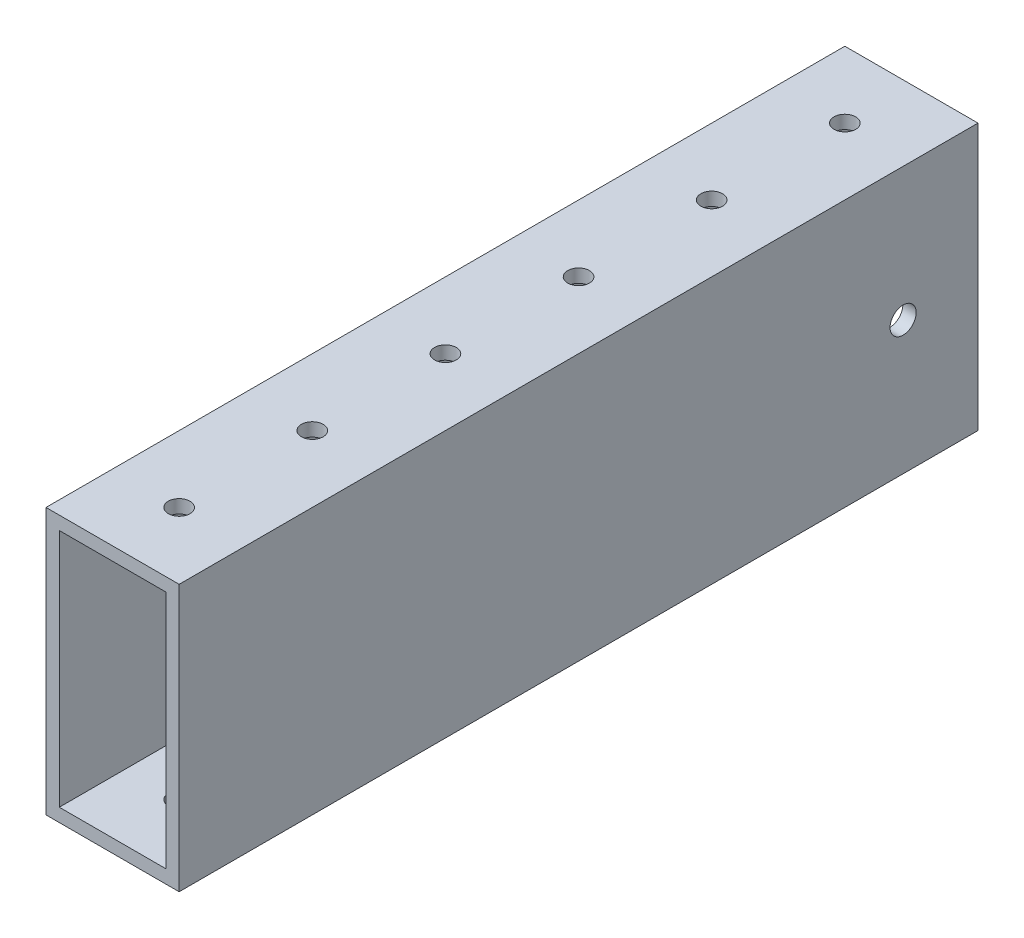
ISO-10303-21;
HEADER;
FILE_DESCRIPTION(('STEP AP214'),'2;1');
FILE_NAME('part.step','',(''),(''),'','','');
FILE_SCHEMA(('AUTOMOTIVE_DESIGN { 1 0 10303 214 1 1 1 1 }'));
ENDSEC;
DATA;
#1=APPLICATION_CONTEXT('core data for automotive mechanical design processes');
#2=APPLICATION_PROTOCOL_DEFINITION('international standard','automotive_design',2000,#1);
#3=PRODUCT_CONTEXT('',#1,'mechanical');
#4=PRODUCT('Part','Part','',(#3));
#5=PRODUCT_RELATED_PRODUCT_CATEGORY('part','',(#4));
#6=PRODUCT_DEFINITION_FORMATION('','',#4);
#7=PRODUCT_DEFINITION_CONTEXT('part definition',#1,'design');
#8=PRODUCT_DEFINITION('design','',#6,#7);
#9=PRODUCT_DEFINITION_SHAPE('','',#8);
#10=(LENGTH_UNIT() NAMED_UNIT(*) SI_UNIT(.MILLI.,.METRE.));
#11=(NAMED_UNIT(*) PLANE_ANGLE_UNIT() SI_UNIT($,.RADIAN.));
#12=(NAMED_UNIT(*) SI_UNIT($,.STERADIAN.) SOLID_ANGLE_UNIT());
#13=UNCERTAINTY_MEASURE_WITH_UNIT(LENGTH_MEASURE(1.E-05),#10,'distance_accuracy_value','');
#14=(GEOMETRIC_REPRESENTATION_CONTEXT(3) GLOBAL_UNCERTAINTY_ASSIGNED_CONTEXT((#13)) GLOBAL_UNIT_ASSIGNED_CONTEXT((#10,
#11,#12)) REPRESENTATION_CONTEXT('',''));
#15=CARTESIAN_POINT('',(0.,0.,0.));
#16=DIRECTION('',(0.,0.,1.));
#17=DIRECTION('',(1.,0.,0.));
#18=AXIS2_PLACEMENT_3D('',#15,#16,#17);
#19=CARTESIAN_POINT('',(0.,0.,76.2));
#20=DIRECTION('',(0.,0.,1.));
#21=DIRECTION('',(1.,0.,0.));
#22=AXIS2_PLACEMENT_3D('',#19,#20,#21);
#23=PLANE('',#22);
#24=DIRECTION('',(0.,1.,0.));
#25=VECTOR('',#24,1.);
#26=CARTESIAN_POINT('',(12.7,-25.4,76.2));
#27=LINE('',#26,#25);
#28=CARTESIAN_POINT('',(12.7,-25.4,76.2));
#29=VERTEX_POINT('',#28);
#30=CARTESIAN_POINT('',(12.7,25.4,76.2));
#31=VERTEX_POINT('',#30);
#32=EDGE_CURVE('E182',#29,#31,#27,.T.);
#33=ORIENTED_EDGE('',*,*,#32,.T.);
#34=DIRECTION('',(-1.,0.,0.));
#35=VECTOR('',#34,1.);
#36=CARTESIAN_POINT('',(-12.7,25.4,76.2));
#37=LINE('',#36,#35);
#38=CARTESIAN_POINT('',(-12.7,25.4,76.2));
#39=VERTEX_POINT('',#38);
#40=EDGE_CURVE('E186',#31,#39,#37,.T.);
#41=ORIENTED_EDGE('',*,*,#40,.T.);
#42=DIRECTION('',(0.,-1.,0.));
#43=VECTOR('',#42,1.);
#44=CARTESIAN_POINT('',(-12.7,-25.4,76.2));
#45=LINE('',#44,#43);
#46=CARTESIAN_POINT('',(-12.7,-25.4,76.2));
#47=VERTEX_POINT('',#46);
#48=EDGE_CURVE('E190',#39,#47,#45,.T.);
#49=ORIENTED_EDGE('',*,*,#48,.T.);
#50=DIRECTION('',(1.,0.,0.));
#51=VECTOR('',#50,1.);
#52=CARTESIAN_POINT('',(-12.7,-25.4,76.2));
#53=LINE('',#52,#51);
#54=EDGE_CURVE('E193',#47,#29,#53,.T.);
#55=ORIENTED_EDGE('',*,*,#54,.T.);
#56=EDGE_LOOP('',(#33,#41,#49,#55));
#57=FACE_BOUND('',#56,.T.);
#58=DIRECTION('',(-1.,0.,0.));
#59=VECTOR('',#58,1.);
#60=CARTESIAN_POINT('',(0.,22.86,76.2));
#61=LINE('',#60,#59);
#62=CARTESIAN_POINT('',(10.16,22.86,76.2));
#63=VERTEX_POINT('',#62);
#64=CARTESIAN_POINT('',(-10.16,22.86,76.2));
#65=VERTEX_POINT('',#64);
#66=EDGE_CURVE('E141',#63,#65,#61,.T.);
#67=ORIENTED_EDGE('',*,*,#66,.F.);
#68=DIRECTION('',(0.,1.,0.));
#69=VECTOR('',#68,1.);
#70=CARTESIAN_POINT('',(10.16,0.,76.2));
#71=LINE('',#70,#69);
#72=CARTESIAN_POINT('',(10.16,-22.86,76.2));
#73=VERTEX_POINT('',#72);
#74=EDGE_CURVE('E132',#73,#63,#71,.T.);
#75=ORIENTED_EDGE('',*,*,#74,.F.);
#76=DIRECTION('',(1.,0.,0.));
#77=VECTOR('',#76,1.);
#78=CARTESIAN_POINT('',(0.,-22.86,76.2));
#79=LINE('',#78,#77);
#80=CARTESIAN_POINT('',(-10.16,-22.86,76.2));
#81=VERTEX_POINT('',#80);
#82=EDGE_CURVE('E158',#81,#73,#79,.T.);
#83=ORIENTED_EDGE('',*,*,#82,.F.);
#84=DIRECTION('',(0.,-1.,0.));
#85=VECTOR('',#84,1.);
#86=CARTESIAN_POINT('',(-10.16,0.,76.2));
#87=LINE('',#86,#85);
#88=EDGE_CURVE('E154',#65,#81,#87,.T.);
#89=ORIENTED_EDGE('',*,*,#88,.F.);
#90=EDGE_LOOP('',(#67,#75,#83,#89));
#91=FACE_BOUND('',#90,.T.);
#92=ADVANCED_FACE('F64',(#57,#91),#23,.T.);
#93=CARTESIAN_POINT('',(0.,0.,-76.2));
#94=DIRECTION('',(0.,0.,1.));
#95=DIRECTION('',(1.,0.,0.));
#96=AXIS2_PLACEMENT_3D('',#93,#94,#95);
#97=PLANE('',#96);
#98=DIRECTION('',(0.,1.,0.));
#99=VECTOR('',#98,1.);
#100=CARTESIAN_POINT('',(12.7,-25.4,-76.2));
#101=LINE('',#100,#99);
#102=CARTESIAN_POINT('',(12.7,-25.4,-76.2));
#103=VERTEX_POINT('',#102);
#104=CARTESIAN_POINT('',(12.7,25.4,-76.2));
#105=VERTEX_POINT('',#104);
#106=EDGE_CURVE('E150',#103,#105,#101,.T.);
#107=ORIENTED_EDGE('',*,*,#106,.F.);
#108=DIRECTION('',(1.,0.,0.));
#109=VECTOR('',#108,1.);
#110=CARTESIAN_POINT('',(-12.7,-25.4,-76.2));
#111=LINE('',#110,#109);
#112=CARTESIAN_POINT('',(-12.7,-25.4,-76.2));
#113=VERTEX_POINT('',#112);
#114=EDGE_CURVE('E187',#113,#103,#111,.T.);
#115=ORIENTED_EDGE('',*,*,#114,.F.);
#116=DIRECTION('',(0.,-1.,0.));
#117=VECTOR('',#116,1.);
#118=CARTESIAN_POINT('',(-12.7,-25.4,-76.2));
#119=LINE('',#118,#117);
#120=CARTESIAN_POINT('',(-12.7,25.4,-76.2));
#121=VERTEX_POINT('',#120);
#122=EDGE_CURVE('E203',#121,#113,#119,.T.);
#123=ORIENTED_EDGE('',*,*,#122,.F.);
#124=DIRECTION('',(-1.,0.,0.));
#125=VECTOR('',#124,1.);
#126=CARTESIAN_POINT('',(-12.7,25.4,-76.2));
#127=LINE('',#126,#125);
#128=EDGE_CURVE('E200',#105,#121,#127,.T.);
#129=ORIENTED_EDGE('',*,*,#128,.F.);
#130=EDGE_LOOP('',(#107,#115,#123,#129));
#131=FACE_BOUND('',#130,.T.);
#132=DIRECTION('',(0.,1.,0.));
#133=VECTOR('',#132,1.);
#134=CARTESIAN_POINT('',(10.16,0.,-76.2));
#135=LINE('',#134,#133);
#136=CARTESIAN_POINT('',(10.16,-22.86,-76.2));
#137=VERTEX_POINT('',#136);
#138=CARTESIAN_POINT('',(10.16,22.86,-76.2));
#139=VERTEX_POINT('',#138);
#140=EDGE_CURVE('E90',#137,#139,#135,.T.);
#141=ORIENTED_EDGE('',*,*,#140,.T.);
#142=DIRECTION('',(-1.,0.,0.));
#143=VECTOR('',#142,1.);
#144=CARTESIAN_POINT('',(0.,22.86,-76.2));
#145=LINE('',#144,#143);
#146=CARTESIAN_POINT('',(-10.16,22.86,-76.2));
#147=VERTEX_POINT('',#146);
#148=EDGE_CURVE('E148',#139,#147,#145,.T.);
#149=ORIENTED_EDGE('',*,*,#148,.T.);
#150=DIRECTION('',(0.,-1.,0.));
#151=VECTOR('',#150,1.);
#152=CARTESIAN_POINT('',(-10.16,0.,-76.2));
#153=LINE('',#152,#151);
#154=CARTESIAN_POINT('',(-10.16,-22.86,-76.2));
#155=VERTEX_POINT('',#154);
#156=EDGE_CURVE('E169',#147,#155,#153,.T.);
#157=ORIENTED_EDGE('',*,*,#156,.T.);
#158=DIRECTION('',(1.,0.,0.));
#159=VECTOR('',#158,1.);
#160=CARTESIAN_POINT('',(0.,-22.86,-76.2));
#161=LINE('',#160,#159);
#162=EDGE_CURVE('E142',#155,#137,#161,.T.);
#163=ORIENTED_EDGE('',*,*,#162,.T.);
#164=EDGE_LOOP('',(#141,#149,#157,#163));
#165=FACE_BOUND('',#164,.T.);
#166=ADVANCED_FACE('F290',(#131,#165),#97,.F.);
#167=CARTESIAN_POINT('',(12.7,-25.4,76.2));
#168=DIRECTION('',(-1.,0.,0.));
#169=DIRECTION('',(0.,0.,1.));
#170=AXIS2_PLACEMENT_3D('',#167,#168,#169);
#171=PLANE('',#170);
#172=CARTESIAN_POINT('',(12.7,0.,-61.9125));
#173=DIRECTION('',(1.,0.,0.));
#174=DIRECTION('',(0.,0.,-1.));
#175=AXIS2_PLACEMENT_3D('',#172,#173,#174);
#176=CIRCLE('',#175,2.48920000000001);
#177=CARTESIAN_POINT('',(12.7,0.,-64.4017));
#178=VERTEX_POINT('',#177);
#179=EDGE_CURVE('E401',#178,#178,#176,.T.);
#180=ORIENTED_EDGE('',*,*,#179,.F.);
#181=EDGE_LOOP('',(#180));
#182=FACE_BOUND('',#181,.T.);
#183=ORIENTED_EDGE('',*,*,#106,.T.);
#184=DIRECTION('',(0.,0.,-1.));
#185=VECTOR('',#184,1.);
#186=CARTESIAN_POINT('',(12.7,25.4,76.2));
#187=LINE('',#186,#185);
#188=EDGE_CURVE('E12',#31,#105,#187,.T.);
#189=ORIENTED_EDGE('',*,*,#188,.F.);
#190=ORIENTED_EDGE('',*,*,#32,.F.);
#191=DIRECTION('',(0.,0.,-1.));
#192=VECTOR('',#191,1.);
#193=CARTESIAN_POINT('',(12.7,-25.4,76.2));
#194=LINE('',#193,#192);
#195=EDGE_CURVE('E196',#29,#103,#194,.T.);
#196=ORIENTED_EDGE('',*,*,#195,.T.);
#197=EDGE_LOOP('',(#183,#189,#190,#196));
#198=FACE_BOUND('',#197,.T.);
#199=ADVANCED_FACE('F66',(#182,#198),#171,.F.);
#200=CARTESIAN_POINT('',(-12.7,25.4,76.2));
#201=DIRECTION('',(0.,-1.,0.));
#202=DIRECTION('',(0.,0.,-1.));
#203=AXIS2_PLACEMENT_3D('',#200,#201,#202);
#204=PLANE('',#203);
#205=CARTESIAN_POINT('',(0.,25.4,38.1));
#206=DIRECTION('',(0.,1.,0.));
#207=DIRECTION('',(0.,0.,1.));
#208=AXIS2_PLACEMENT_3D('',#205,#206,#207);
#209=CIRCLE('',#208,2.0701);
#210=CARTESIAN_POINT('',(0.,25.4,40.1701));
#211=VERTEX_POINT('',#210);
#212=EDGE_CURVE('E315',#211,#211,#209,.T.);
#213=ORIENTED_EDGE('',*,*,#212,.F.);
#214=EDGE_LOOP('',(#213));
#215=FACE_BOUND('',#214,.T.);
#216=CARTESIAN_POINT('',(0.,25.4,12.7));
#217=DIRECTION('',(0.,1.,0.));
#218=DIRECTION('',(0.,0.,1.));
#219=AXIS2_PLACEMENT_3D('',#216,#217,#218);
#220=CIRCLE('',#219,2.0701);
#221=CARTESIAN_POINT('',(0.,25.4,14.7701));
#222=VERTEX_POINT('',#221);
#223=EDGE_CURVE('E319',#222,#222,#220,.T.);
#224=ORIENTED_EDGE('',*,*,#223,.F.);
#225=EDGE_LOOP('',(#224));
#226=FACE_BOUND('',#225,.T.);
#227=CARTESIAN_POINT('',(0.,25.4,-12.7));
#228=DIRECTION('',(0.,1.,0.));
#229=DIRECTION('',(0.,0.,1.));
#230=AXIS2_PLACEMENT_3D('',#227,#228,#229);
#231=CIRCLE('',#230,2.0701);
#232=CARTESIAN_POINT('',(0.,25.4,-10.6299));
#233=VERTEX_POINT('',#232);
#234=EDGE_CURVE('E323',#233,#233,#231,.T.);
#235=ORIENTED_EDGE('',*,*,#234,.F.);
#236=EDGE_LOOP('',(#235));
#237=FACE_BOUND('',#236,.T.);
#238=CARTESIAN_POINT('',(0.,25.4,-38.1));
#239=DIRECTION('',(0.,1.,0.));
#240=DIRECTION('',(0.,0.,1.));
#241=AXIS2_PLACEMENT_3D('',#238,#239,#240);
#242=CIRCLE('',#241,2.0701);
#243=CARTESIAN_POINT('',(0.,25.4,-36.0299));
#244=VERTEX_POINT('',#243);
#245=EDGE_CURVE('E327',#244,#244,#242,.T.);
#246=ORIENTED_EDGE('',*,*,#245,.F.);
#247=EDGE_LOOP('',(#246));
#248=FACE_BOUND('',#247,.T.);
#249=CARTESIAN_POINT('',(0.,25.4,-63.5));
#250=DIRECTION('',(0.,1.,0.));
#251=DIRECTION('',(0.,0.,1.));
#252=AXIS2_PLACEMENT_3D('',#249,#250,#251);
#253=CIRCLE('',#252,2.0701);
#254=CARTESIAN_POINT('',(0.,25.4,-61.4299));
#255=VERTEX_POINT('',#254);
#256=EDGE_CURVE('E331',#255,#255,#253,.T.);
#257=ORIENTED_EDGE('',*,*,#256,.F.);
#258=EDGE_LOOP('',(#257));
#259=FACE_BOUND('',#258,.T.);
#260=CARTESIAN_POINT('',(0.,25.4,63.5));
#261=DIRECTION('',(0.,1.,0.));
#262=DIRECTION('',(0.,0.,1.));
#263=AXIS2_PLACEMENT_3D('',#260,#261,#262);
#264=CIRCLE('',#263,2.0701);
#265=CARTESIAN_POINT('',(0.,25.4,65.5701));
#266=VERTEX_POINT('',#265);
#267=EDGE_CURVE('E252',#266,#266,#264,.T.);
#268=ORIENTED_EDGE('',*,*,#267,.F.);
#269=EDGE_LOOP('',(#268));
#270=FACE_BOUND('',#269,.T.);
#271=ORIENTED_EDGE('',*,*,#128,.T.);
#272=DIRECTION('',(0.,0.,-1.));
#273=VECTOR('',#272,1.);
#274=CARTESIAN_POINT('',(-12.7,25.4,76.2));
#275=LINE('',#274,#273);
#276=EDGE_CURVE('E74',#39,#121,#275,.T.);
#277=ORIENTED_EDGE('',*,*,#276,.F.);
#278=ORIENTED_EDGE('',*,*,#40,.F.);
#279=ORIENTED_EDGE('',*,*,#188,.T.);
#280=EDGE_LOOP('',(#271,#277,#278,#279));
#281=FACE_BOUND('',#280,.T.);
#282=ADVANCED_FACE('F304',(#215,#226,#237,#248,#259,#270,#281),#204,.F.);
#283=CARTESIAN_POINT('',(-12.7,-25.4,76.2));
#284=DIRECTION('',(1.,0.,0.));
#285=DIRECTION('',(0.,0.,-1.));
#286=AXIS2_PLACEMENT_3D('',#283,#284,#285);
#287=PLANE('',#286);
#288=CARTESIAN_POINT('',(-12.7,0.,-61.9125));
#289=DIRECTION('',(1.,0.,0.));
#290=DIRECTION('',(0.,0.,-1.));
#291=AXIS2_PLACEMENT_3D('',#288,#289,#290);
#292=CIRCLE('',#291,2.48920000000001);
#293=CARTESIAN_POINT('',(-12.7,0.,-64.4017));
#294=VERTEX_POINT('',#293);
#295=EDGE_CURVE('E399',#294,#294,#292,.T.);
#296=ORIENTED_EDGE('',*,*,#295,.T.);
#297=EDGE_LOOP('',(#296));
#298=FACE_BOUND('',#297,.T.);
#299=ORIENTED_EDGE('',*,*,#122,.T.);
#300=DIRECTION('',(0.,0.,-1.));
#301=VECTOR('',#300,1.);
#302=CARTESIAN_POINT('',(-12.7,-25.4,76.2));
#303=LINE('',#302,#301);
#304=EDGE_CURVE('E211',#47,#113,#303,.T.);
#305=ORIENTED_EDGE('',*,*,#304,.F.);
#306=ORIENTED_EDGE('',*,*,#48,.F.);
#307=ORIENTED_EDGE('',*,*,#276,.T.);
#308=EDGE_LOOP('',(#299,#305,#306,#307));
#309=FACE_BOUND('',#308,.T.);
#310=ADVANCED_FACE('F301',(#298,#309),#287,.F.);
#311=CARTESIAN_POINT('',(-12.7,-25.4,76.2));
#312=DIRECTION('',(0.,1.,0.));
#313=DIRECTION('',(0.,0.,1.));
#314=AXIS2_PLACEMENT_3D('',#311,#312,#313);
#315=PLANE('',#314);
#316=CARTESIAN_POINT('',(0.,-25.4,38.1));
#317=DIRECTION('',(0.,1.,0.));
#318=DIRECTION('',(0.,0.,1.));
#319=AXIS2_PLACEMENT_3D('',#316,#317,#318);
#320=CIRCLE('',#319,2.0701);
#321=CARTESIAN_POINT('',(0.,-25.4,40.1701));
#322=VERTEX_POINT('',#321);
#323=EDGE_CURVE('E228',#322,#322,#320,.T.);
#324=ORIENTED_EDGE('',*,*,#323,.T.);
#325=EDGE_LOOP('',(#324));
#326=FACE_BOUND('',#325,.T.);
#327=CARTESIAN_POINT('',(0.,-25.4,12.7));
#328=DIRECTION('',(0.,1.,0.));
#329=DIRECTION('',(0.,0.,1.));
#330=AXIS2_PLACEMENT_3D('',#327,#328,#329);
#331=CIRCLE('',#330,2.0701);
#332=CARTESIAN_POINT('',(0.,-25.4,14.7701));
#333=VERTEX_POINT('',#332);
#334=EDGE_CURVE('E417',#333,#333,#331,.T.);
#335=ORIENTED_EDGE('',*,*,#334,.T.);
#336=EDGE_LOOP('',(#335));
#337=FACE_BOUND('',#336,.T.);
#338=CARTESIAN_POINT('',(0.,-25.4,-12.7));
#339=DIRECTION('',(0.,1.,0.));
#340=DIRECTION('',(0.,0.,1.));
#341=AXIS2_PLACEMENT_3D('',#338,#339,#340);
#342=CIRCLE('',#341,2.0701);
#343=CARTESIAN_POINT('',(0.,-25.4,-10.6299));
#344=VERTEX_POINT('',#343);
#345=EDGE_CURVE('E423',#344,#344,#342,.T.);
#346=ORIENTED_EDGE('',*,*,#345,.T.);
#347=EDGE_LOOP('',(#346));
#348=FACE_BOUND('',#347,.T.);
#349=CARTESIAN_POINT('',(0.,-25.4,-38.1));
#350=DIRECTION('',(0.,1.,0.));
#351=DIRECTION('',(0.,0.,1.));
#352=AXIS2_PLACEMENT_3D('',#349,#350,#351);
#353=CIRCLE('',#352,2.0701);
#354=CARTESIAN_POINT('',(0.,-25.4,-36.0299));
#355=VERTEX_POINT('',#354);
#356=EDGE_CURVE('E429',#355,#355,#353,.T.);
#357=ORIENTED_EDGE('',*,*,#356,.T.);
#358=EDGE_LOOP('',(#357));
#359=FACE_BOUND('',#358,.T.);
#360=CARTESIAN_POINT('',(0.,-25.4,-63.5));
#361=DIRECTION('',(0.,1.,0.));
#362=DIRECTION('',(0.,0.,1.));
#363=AXIS2_PLACEMENT_3D('',#360,#361,#362);
#364=CIRCLE('',#363,2.0701);
#365=CARTESIAN_POINT('',(0.,-25.4,-61.4299));
#366=VERTEX_POINT('',#365);
#367=EDGE_CURVE('E435',#366,#366,#364,.T.);
#368=ORIENTED_EDGE('',*,*,#367,.T.);
#369=EDGE_LOOP('',(#368));
#370=FACE_BOUND('',#369,.T.);
#371=CARTESIAN_POINT('',(0.,-25.4,63.5));
#372=DIRECTION('',(0.,1.,0.));
#373=DIRECTION('',(0.,0.,1.));
#374=AXIS2_PLACEMENT_3D('',#371,#372,#373);
#375=CIRCLE('',#374,2.0701);
#376=CARTESIAN_POINT('',(0.,-25.4,65.5701));
#377=VERTEX_POINT('',#376);
#378=EDGE_CURVE('E222',#377,#377,#375,.T.);
#379=ORIENTED_EDGE('',*,*,#378,.T.);
#380=EDGE_LOOP('',(#379));
#381=FACE_BOUND('',#380,.T.);
#382=ORIENTED_EDGE('',*,*,#114,.T.);
#383=ORIENTED_EDGE('',*,*,#195,.F.);
#384=ORIENTED_EDGE('',*,*,#54,.F.);
#385=ORIENTED_EDGE('',*,*,#304,.T.);
#386=EDGE_LOOP('',(#382,#383,#384,#385));
#387=FACE_BOUND('',#386,.T.);
#388=ADVANCED_FACE('F284',(#326,#337,#348,#359,#370,#381,#387),#315,.F.);
#389=CARTESIAN_POINT('',(10.16,0.,76.2));
#390=DIRECTION('',(-1.,0.,0.));
#391=DIRECTION('',(0.,0.,1.));
#392=AXIS2_PLACEMENT_3D('',#389,#390,#391);
#393=PLANE('',#392);
#394=CARTESIAN_POINT('',(10.16,0.,-61.9125));
#395=DIRECTION('',(-1.,0.,0.));
#396=DIRECTION('',(0.,0.,1.));
#397=AXIS2_PLACEMENT_3D('',#394,#395,#396);
#398=CIRCLE('',#397,2.48920000000001);
#399=CARTESIAN_POINT('',(10.16,0.,-59.4233));
#400=VERTEX_POINT('',#399);
#401=EDGE_CURVE('E405',#400,#400,#398,.T.);
#402=ORIENTED_EDGE('',*,*,#401,.F.);
#403=EDGE_LOOP('',(#402));
#404=FACE_BOUND('',#403,.T.);
#405=ORIENTED_EDGE('',*,*,#140,.F.);
#406=DIRECTION('',(0.,0.,-1.));
#407=VECTOR('',#406,1.);
#408=CARTESIAN_POINT('',(10.16,-22.86,76.2));
#409=LINE('',#408,#407);
#410=EDGE_CURVE('E136',#73,#137,#409,.T.);
#411=ORIENTED_EDGE('',*,*,#410,.F.);
#412=ORIENTED_EDGE('',*,*,#74,.T.);
#413=DIRECTION('',(0.,0.,-1.));
#414=VECTOR('',#413,1.);
#415=CARTESIAN_POINT('',(10.16,22.86,76.2));
#416=LINE('',#415,#414);
#417=EDGE_CURVE('E135',#63,#139,#416,.T.);
#418=ORIENTED_EDGE('',*,*,#417,.T.);
#419=EDGE_LOOP('',(#405,#411,#412,#418));
#420=FACE_BOUND('',#419,.T.);
#421=ADVANCED_FACE('F134',(#404,#420),#393,.T.);
#422=CARTESIAN_POINT('',(0.,22.86,76.2));
#423=DIRECTION('',(0.,-1.,0.));
#424=DIRECTION('',(0.,0.,-1.));
#425=AXIS2_PLACEMENT_3D('',#422,#423,#424);
#426=PLANE('',#425);
#427=CARTESIAN_POINT('',(0.,22.86,38.1));
#428=DIRECTION('',(0.,-1.,0.));
#429=DIRECTION('',(0.,0.,-1.));
#430=AXIS2_PLACEMENT_3D('',#427,#428,#429);
#431=CIRCLE('',#430,2.0701);
#432=CARTESIAN_POINT('',(0.,22.86,36.0299));
#433=VERTEX_POINT('',#432);
#434=EDGE_CURVE('E246',#433,#433,#431,.T.);
#435=ORIENTED_EDGE('',*,*,#434,.F.);
#436=EDGE_LOOP('',(#435));
#437=FACE_BOUND('',#436,.T.);
#438=CARTESIAN_POINT('',(0.,22.86,12.7));
#439=DIRECTION('',(0.,-1.,0.));
#440=DIRECTION('',(0.,0.,-1.));
#441=AXIS2_PLACEMENT_3D('',#438,#439,#440);
#442=CIRCLE('',#441,2.0701);
#443=CARTESIAN_POINT('',(0.,22.86,10.6299));
#444=VERTEX_POINT('',#443);
#445=EDGE_CURVE('E242',#444,#444,#442,.T.);
#446=ORIENTED_EDGE('',*,*,#445,.F.);
#447=EDGE_LOOP('',(#446));
#448=FACE_BOUND('',#447,.T.);
#449=CARTESIAN_POINT('',(0.,22.86,-12.7));
#450=DIRECTION('',(0.,-1.,0.));
#451=DIRECTION('',(0.,0.,-1.));
#452=AXIS2_PLACEMENT_3D('',#449,#450,#451);
#453=CIRCLE('',#452,2.0701);
#454=CARTESIAN_POINT('',(0.,22.86,-14.7701));
#455=VERTEX_POINT('',#454);
#456=EDGE_CURVE('E238',#455,#455,#453,.T.);
#457=ORIENTED_EDGE('',*,*,#456,.F.);
#458=EDGE_LOOP('',(#457));
#459=FACE_BOUND('',#458,.T.);
#460=CARTESIAN_POINT('',(0.,22.86,-38.1));
#461=DIRECTION('',(0.,-1.,0.));
#462=DIRECTION('',(0.,0.,-1.));
#463=AXIS2_PLACEMENT_3D('',#460,#461,#462);
#464=CIRCLE('',#463,2.0701);
#465=CARTESIAN_POINT('',(0.,22.86,-40.1701));
#466=VERTEX_POINT('',#465);
#467=EDGE_CURVE('E233',#466,#466,#464,.T.);
#468=ORIENTED_EDGE('',*,*,#467,.F.);
#469=EDGE_LOOP('',(#468));
#470=FACE_BOUND('',#469,.T.);
#471=CARTESIAN_POINT('',(0.,22.86,-63.5));
#472=DIRECTION('',(0.,-1.,0.));
#473=DIRECTION('',(0.,0.,-1.));
#474=AXIS2_PLACEMENT_3D('',#471,#472,#473);
#475=CIRCLE('',#474,2.0701);
#476=CARTESIAN_POINT('',(0.,22.86,-65.5701));
#477=VERTEX_POINT('',#476);
#478=EDGE_CURVE('E227',#477,#477,#475,.T.);
#479=ORIENTED_EDGE('',*,*,#478,.F.);
#480=EDGE_LOOP('',(#479));
#481=FACE_BOUND('',#480,.T.);
#482=CARTESIAN_POINT('',(0.,22.86,63.5));
#483=DIRECTION('',(0.,-1.,0.));
#484=DIRECTION('',(0.,0.,-1.));
#485=AXIS2_PLACEMENT_3D('',#482,#483,#484);
#486=CIRCLE('',#485,2.0701);
#487=CARTESIAN_POINT('',(0.,22.86,61.4299));
#488=VERTEX_POINT('',#487);
#489=EDGE_CURVE('E166',#488,#488,#486,.T.);
#490=ORIENTED_EDGE('',*,*,#489,.F.);
#491=EDGE_LOOP('',(#490));
#492=FACE_BOUND('',#491,.T.);
#493=ORIENTED_EDGE('',*,*,#148,.F.);
#494=ORIENTED_EDGE('',*,*,#417,.F.);
#495=ORIENTED_EDGE('',*,*,#66,.T.);
#496=DIRECTION('',(0.,0.,-1.));
#497=VECTOR('',#496,1.);
#498=CARTESIAN_POINT('',(-10.16,22.86,76.2));
#499=LINE('',#498,#497);
#500=EDGE_CURVE('E151',#65,#147,#499,.T.);
#501=ORIENTED_EDGE('',*,*,#500,.T.);
#502=EDGE_LOOP('',(#493,#494,#495,#501));
#503=FACE_BOUND('',#502,.T.);
#504=ADVANCED_FACE('F145',(#437,#448,#459,#470,#481,#492,#503),#426,.T.);
#505=CARTESIAN_POINT('',(-10.16,0.,76.2));
#506=DIRECTION('',(1.,0.,0.));
#507=DIRECTION('',(0.,0.,-1.));
#508=AXIS2_PLACEMENT_3D('',#505,#506,#507);
#509=PLANE('',#508);
#510=CARTESIAN_POINT('',(-10.16,0.,-61.9125));
#511=DIRECTION('',(1.,0.,0.));
#512=DIRECTION('',(0.,0.,-1.));
#513=AXIS2_PLACEMENT_3D('',#510,#511,#512);
#514=CIRCLE('',#513,2.48920000000001);
#515=CARTESIAN_POINT('',(-10.16,0.,-64.4017));
#516=VERTEX_POINT('',#515);
#517=EDGE_CURVE('E68',#516,#516,#514,.T.);
#518=ORIENTED_EDGE('',*,*,#517,.F.);
#519=EDGE_LOOP('',(#518));
#520=FACE_BOUND('',#519,.T.);
#521=ORIENTED_EDGE('',*,*,#156,.F.);
#522=ORIENTED_EDGE('',*,*,#500,.F.);
#523=ORIENTED_EDGE('',*,*,#88,.T.);
#524=DIRECTION('',(0.,0.,-1.));
#525=VECTOR('',#524,1.);
#526=CARTESIAN_POINT('',(-10.16,-22.86,76.2));
#527=LINE('',#526,#525);
#528=EDGE_CURVE('E82',#81,#155,#527,.T.);
#529=ORIENTED_EDGE('',*,*,#528,.T.);
#530=EDGE_LOOP('',(#521,#522,#523,#529));
#531=FACE_BOUND('',#530,.T.);
#532=ADVANCED_FACE('F274',(#520,#531),#509,.T.);
#533=CARTESIAN_POINT('',(0.,-22.86,76.2));
#534=DIRECTION('',(0.,1.,0.));
#535=DIRECTION('',(0.,0.,1.));
#536=AXIS2_PLACEMENT_3D('',#533,#534,#535);
#537=PLANE('',#536);
#538=CARTESIAN_POINT('',(0.,-22.86,38.1));
#539=DIRECTION('',(0.,1.,0.));
#540=DIRECTION('',(0.,0.,1.));
#541=AXIS2_PLACEMENT_3D('',#538,#539,#540);
#542=CIRCLE('',#541,2.0701);
#543=CARTESIAN_POINT('',(0.,-22.86,40.1701));
#544=VERTEX_POINT('',#543);
#545=EDGE_CURVE('E243',#544,#544,#542,.T.);
#546=ORIENTED_EDGE('',*,*,#545,.F.);
#547=EDGE_LOOP('',(#546));
#548=FACE_BOUND('',#547,.T.);
#549=CARTESIAN_POINT('',(0.,-22.86,12.7));
#550=DIRECTION('',(0.,1.,0.));
#551=DIRECTION('',(0.,0.,1.));
#552=AXIS2_PLACEMENT_3D('',#549,#550,#551);
#553=CIRCLE('',#552,2.0701);
#554=CARTESIAN_POINT('',(0.,-22.86,14.7701));
#555=VERTEX_POINT('',#554);
#556=EDGE_CURVE('E239',#555,#555,#553,.T.);
#557=ORIENTED_EDGE('',*,*,#556,.F.);
#558=EDGE_LOOP('',(#557));
#559=FACE_BOUND('',#558,.T.);
#560=CARTESIAN_POINT('',(0.,-22.86,-12.7));
#561=DIRECTION('',(0.,1.,0.));
#562=DIRECTION('',(0.,0.,1.));
#563=AXIS2_PLACEMENT_3D('',#560,#561,#562);
#564=CIRCLE('',#563,2.0701);
#565=CARTESIAN_POINT('',(0.,-22.86,-10.6299));
#566=VERTEX_POINT('',#565);
#567=EDGE_CURVE('E234',#566,#566,#564,.T.);
#568=ORIENTED_EDGE('',*,*,#567,.F.);
#569=EDGE_LOOP('',(#568));
#570=FACE_BOUND('',#569,.T.);
#571=CARTESIAN_POINT('',(0.,-22.86,-38.1));
#572=DIRECTION('',(0.,1.,0.));
#573=DIRECTION('',(0.,0.,1.));
#574=AXIS2_PLACEMENT_3D('',#571,#572,#573);
#575=CIRCLE('',#574,2.0701);
#576=CARTESIAN_POINT('',(0.,-22.86,-36.0299));
#577=VERTEX_POINT('',#576);
#578=EDGE_CURVE('E229',#577,#577,#575,.T.);
#579=ORIENTED_EDGE('',*,*,#578,.F.);
#580=EDGE_LOOP('',(#579));
#581=FACE_BOUND('',#580,.T.);
#582=CARTESIAN_POINT('',(0.,-22.86,-63.5));
#583=DIRECTION('',(0.,1.,0.));
#584=DIRECTION('',(0.,0.,1.));
#585=AXIS2_PLACEMENT_3D('',#582,#583,#584);
#586=CIRCLE('',#585,2.0701);
#587=CARTESIAN_POINT('',(0.,-22.86,-61.4299));
#588=VERTEX_POINT('',#587);
#589=EDGE_CURVE('E223',#588,#588,#586,.T.);
#590=ORIENTED_EDGE('',*,*,#589,.F.);
#591=EDGE_LOOP('',(#590));
#592=FACE_BOUND('',#591,.T.);
#593=CARTESIAN_POINT('',(0.,-22.86,63.5));
#594=DIRECTION('',(0.,1.,0.));
#595=DIRECTION('',(0.,0.,1.));
#596=AXIS2_PLACEMENT_3D('',#593,#594,#595);
#597=CIRCLE('',#596,2.0701);
#598=CARTESIAN_POINT('',(0.,-22.86,65.5701));
#599=VERTEX_POINT('',#598);
#600=EDGE_CURVE('E218',#599,#599,#597,.T.);
#601=ORIENTED_EDGE('',*,*,#600,.F.);
#602=EDGE_LOOP('',(#601));
#603=FACE_BOUND('',#602,.T.);
#604=ORIENTED_EDGE('',*,*,#162,.F.);
#605=ORIENTED_EDGE('',*,*,#528,.F.);
#606=ORIENTED_EDGE('',*,*,#82,.T.);
#607=ORIENTED_EDGE('',*,*,#410,.T.);
#608=EDGE_LOOP('',(#604,#605,#606,#607));
#609=FACE_BOUND('',#608,.T.);
#610=ADVANCED_FACE('F281',(#548,#559,#570,#581,#592,#603,#609),#537,.T.);
#611=CARTESIAN_POINT('',(0.,-25.4,63.5));
#612=DIRECTION('',(0.,1.,0.));
#613=DIRECTION('',(0.,0.,1.));
#614=AXIS2_PLACEMENT_3D('',#611,#612,#613);
#615=CYLINDRICAL_SURFACE('',#614,2.0701);
#616=ORIENTED_EDGE('',*,*,#600,.T.);
#617=EDGE_LOOP('',(#616));
#618=FACE_BOUND('',#617,.T.);
#619=ORIENTED_EDGE('',*,*,#378,.F.);
#620=EDGE_LOOP('',(#619));
#621=FACE_BOUND('',#620,.T.);
#622=ADVANCED_FACE('F350',(#618,#621),#615,.F.);
#623=ORIENTED_EDGE('',*,*,#489,.T.);
#624=EDGE_LOOP('',(#623));
#625=FACE_BOUND('',#624,.T.);
#626=ORIENTED_EDGE('',*,*,#267,.T.);
#627=EDGE_LOOP('',(#626));
#628=FACE_BOUND('',#627,.T.);
#629=ADVANCED_FACE('F270',(#625,#628),#615,.F.);
#630=CARTESIAN_POINT('',(0.,-25.4,-63.5));
#631=DIRECTION('',(0.,1.,0.));
#632=DIRECTION('',(0.,0.,1.));
#633=AXIS2_PLACEMENT_3D('',#630,#631,#632);
#634=CYLINDRICAL_SURFACE('',#633,2.0701);
#635=ORIENTED_EDGE('',*,*,#589,.T.);
#636=EDGE_LOOP('',(#635));
#637=FACE_BOUND('',#636,.T.);
#638=ORIENTED_EDGE('',*,*,#367,.F.);
#639=EDGE_LOOP('',(#638));
#640=FACE_BOUND('',#639,.T.);
#641=ADVANCED_FACE('F360',(#637,#640),#634,.F.);
#642=CARTESIAN_POINT('',(0.,-25.4,-38.1));
#643=DIRECTION('',(0.,1.,0.));
#644=DIRECTION('',(0.,0.,1.));
#645=AXIS2_PLACEMENT_3D('',#642,#643,#644);
#646=CYLINDRICAL_SURFACE('',#645,2.0701);
#647=ORIENTED_EDGE('',*,*,#578,.T.);
#648=EDGE_LOOP('',(#647));
#649=FACE_BOUND('',#648,.T.);
#650=ORIENTED_EDGE('',*,*,#356,.F.);
#651=EDGE_LOOP('',(#650));
#652=FACE_BOUND('',#651,.T.);
#653=ADVANCED_FACE('F363',(#649,#652),#646,.F.);
#654=CARTESIAN_POINT('',(0.,-25.4,-12.7));
#655=DIRECTION('',(0.,1.,0.));
#656=DIRECTION('',(0.,0.,1.));
#657=AXIS2_PLACEMENT_3D('',#654,#655,#656);
#658=CYLINDRICAL_SURFACE('',#657,2.0701);
#659=ORIENTED_EDGE('',*,*,#567,.T.);
#660=EDGE_LOOP('',(#659));
#661=FACE_BOUND('',#660,.T.);
#662=ORIENTED_EDGE('',*,*,#345,.F.);
#663=EDGE_LOOP('',(#662));
#664=FACE_BOUND('',#663,.T.);
#665=ADVANCED_FACE('F368',(#661,#664),#658,.F.);
#666=CARTESIAN_POINT('',(0.,-25.4,12.7));
#667=DIRECTION('',(0.,1.,0.));
#668=DIRECTION('',(0.,0.,1.));
#669=AXIS2_PLACEMENT_3D('',#666,#667,#668);
#670=CYLINDRICAL_SURFACE('',#669,2.0701);
#671=ORIENTED_EDGE('',*,*,#556,.T.);
#672=EDGE_LOOP('',(#671));
#673=FACE_BOUND('',#672,.T.);
#674=ORIENTED_EDGE('',*,*,#334,.F.);
#675=EDGE_LOOP('',(#674));
#676=FACE_BOUND('',#675,.T.);
#677=ADVANCED_FACE('F373',(#673,#676),#670,.F.);
#678=CARTESIAN_POINT('',(0.,-25.4,38.1));
#679=DIRECTION('',(0.,1.,0.));
#680=DIRECTION('',(0.,0.,1.));
#681=AXIS2_PLACEMENT_3D('',#678,#679,#680);
#682=CYLINDRICAL_SURFACE('',#681,2.0701);
#683=ORIENTED_EDGE('',*,*,#545,.T.);
#684=EDGE_LOOP('',(#683));
#685=FACE_BOUND('',#684,.T.);
#686=ORIENTED_EDGE('',*,*,#323,.F.);
#687=EDGE_LOOP('',(#686));
#688=FACE_BOUND('',#687,.T.);
#689=ADVANCED_FACE('F378',(#685,#688),#682,.F.);
#690=ORIENTED_EDGE('',*,*,#478,.T.);
#691=EDGE_LOOP('',(#690));
#692=FACE_BOUND('',#691,.T.);
#693=ORIENTED_EDGE('',*,*,#256,.T.);
#694=EDGE_LOOP('',(#693));
#695=FACE_BOUND('',#694,.T.);
#696=ADVANCED_FACE('F365',(#692,#695),#634,.F.);
#697=ORIENTED_EDGE('',*,*,#467,.T.);
#698=EDGE_LOOP('',(#697));
#699=FACE_BOUND('',#698,.T.);
#700=ORIENTED_EDGE('',*,*,#245,.T.);
#701=EDGE_LOOP('',(#700));
#702=FACE_BOUND('',#701,.T.);
#703=ADVANCED_FACE('F370',(#699,#702),#646,.F.);
#704=ORIENTED_EDGE('',*,*,#456,.T.);
#705=EDGE_LOOP('',(#704));
#706=FACE_BOUND('',#705,.T.);
#707=ORIENTED_EDGE('',*,*,#234,.T.);
#708=EDGE_LOOP('',(#707));
#709=FACE_BOUND('',#708,.T.);
#710=ADVANCED_FACE('F375',(#706,#709),#658,.F.);
#711=ORIENTED_EDGE('',*,*,#445,.T.);
#712=EDGE_LOOP('',(#711));
#713=FACE_BOUND('',#712,.T.);
#714=ORIENTED_EDGE('',*,*,#223,.T.);
#715=EDGE_LOOP('',(#714));
#716=FACE_BOUND('',#715,.T.);
#717=ADVANCED_FACE('F380',(#713,#716),#670,.F.);
#718=ORIENTED_EDGE('',*,*,#434,.T.);
#719=EDGE_LOOP('',(#718));
#720=FACE_BOUND('',#719,.T.);
#721=ORIENTED_EDGE('',*,*,#212,.T.);
#722=EDGE_LOOP('',(#721));
#723=FACE_BOUND('',#722,.T.);
#724=ADVANCED_FACE('F383',(#720,#723),#682,.F.);
#725=CARTESIAN_POINT('',(-12.7,0.,-61.9125));
#726=DIRECTION('',(1.,0.,0.));
#727=DIRECTION('',(0.,0.,-1.));
#728=AXIS2_PLACEMENT_3D('',#725,#726,#727);
#729=CYLINDRICAL_SURFACE('',#728,2.48920000000001);
#730=ORIENTED_EDGE('',*,*,#517,.T.);
#731=EDGE_LOOP('',(#730));
#732=FACE_BOUND('',#731,.T.);
#733=ORIENTED_EDGE('',*,*,#295,.F.);
#734=EDGE_LOOP('',(#733));
#735=FACE_BOUND('',#734,.T.);
#736=ADVANCED_FACE('F384',(#732,#735),#729,.F.);
#737=ORIENTED_EDGE('',*,*,#401,.T.);
#738=EDGE_LOOP('',(#737));
#739=FACE_BOUND('',#738,.T.);
#740=ORIENTED_EDGE('',*,*,#179,.T.);
#741=EDGE_LOOP('',(#740));
#742=FACE_BOUND('',#741,.T.);
#743=ADVANCED_FACE('F386',(#739,#742),#729,.F.);
#744=CLOSED_SHELL('',(#92,#166,#199,#282,#310,#388,#421,#504,#532,#610,#622,#629,#641,#653,#665,
#677,#689,#696,#703,#710,#717,#724,#736,#743));
#745=MANIFOLD_SOLID_BREP('B2',#744);
#746=ADVANCED_BREP_SHAPE_REPRESENTATION('',(#18,#745),#14);
#747=SHAPE_DEFINITION_REPRESENTATION(#9,#746);
ENDSEC;
END-ISO-10303-21;
